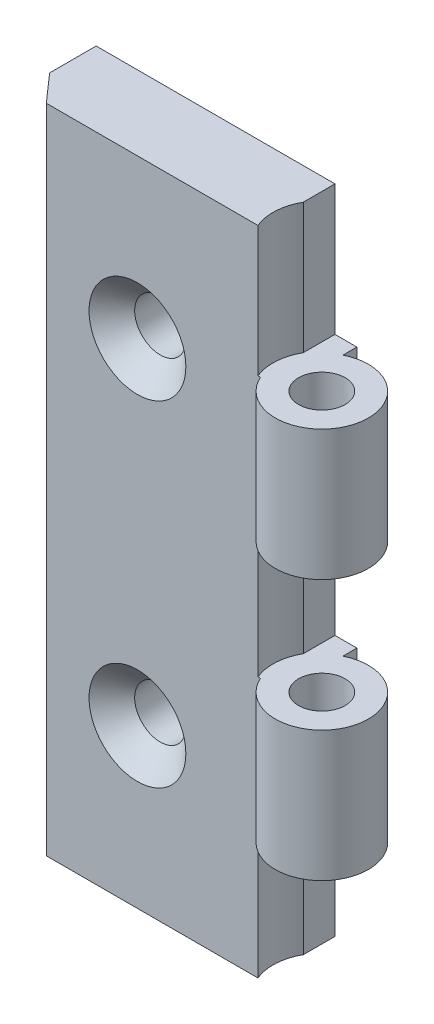
ISO-10303-21;
HEADER;
FILE_DESCRIPTION(('STEP AP214'),'2;1');
FILE_NAME('part.step','',(''),(''),'','','');
FILE_SCHEMA(('AUTOMOTIVE_DESIGN { 1 0 10303 214 1 1 1 1 }'));
ENDSEC;
DATA;
#1=APPLICATION_CONTEXT('core data for automotive mechanical design processes');
#2=APPLICATION_PROTOCOL_DEFINITION('international standard','automotive_design',2000,#1);
#3=PRODUCT_CONTEXT('',#1,'mechanical');
#4=PRODUCT('Part','Part','',(#3));
#5=PRODUCT_RELATED_PRODUCT_CATEGORY('part','',(#4));
#6=PRODUCT_DEFINITION_FORMATION('','',#4);
#7=PRODUCT_DEFINITION_CONTEXT('part definition',#1,'design');
#8=PRODUCT_DEFINITION('design','',#6,#7);
#9=PRODUCT_DEFINITION_SHAPE('','',#8);
#10=(LENGTH_UNIT() NAMED_UNIT(*) SI_UNIT(.MILLI.,.METRE.));
#11=(NAMED_UNIT(*) PLANE_ANGLE_UNIT() SI_UNIT($,.RADIAN.));
#12=(NAMED_UNIT(*) SI_UNIT($,.STERADIAN.) SOLID_ANGLE_UNIT());
#13=UNCERTAINTY_MEASURE_WITH_UNIT(LENGTH_MEASURE(1.E-05),#10,'distance_accuracy_value','');
#14=(GEOMETRIC_REPRESENTATION_CONTEXT(3) GLOBAL_UNCERTAINTY_ASSIGNED_CONTEXT((#13)) GLOBAL_UNIT_ASSIGNED_CONTEXT((#10,
#11,#12)) REPRESENTATION_CONTEXT('',''));
#15=CARTESIAN_POINT('',(0.,0.,0.));
#16=DIRECTION('',(0.,0.,1.));
#17=DIRECTION('',(1.,0.,0.));
#18=AXIS2_PLACEMENT_3D('',#15,#16,#17);
#19=CARTESIAN_POINT('',(30.2196762219613,35.,5.98029435078316));
#20=DIRECTION('',(0.,-1.,0.));
#21=DIRECTION('',(0.,0.,-1.));
#22=AXIS2_PLACEMENT_3D('',#19,#20,#21);
#23=CYLINDRICAL_SURFACE('',#22,5.);
#24=CARTESIAN_POINT('',(30.2196762219613,7.,5.98029435078316));
#25=DIRECTION('',(0.,1.,0.));
#26=DIRECTION('',(0.,0.,1.));
#27=AXIS2_PLACEMENT_3D('',#24,#25,#26);
#28=CIRCLE('',#27,5.);
#29=CARTESIAN_POINT('',(25.6457513110646,7.,8.00000000000001));
#30=VERTEX_POINT('',#29);
#31=CARTESIAN_POINT('',(28.,7.,1.5));
#32=VERTEX_POINT('',#31);
#33=EDGE_CURVE('E276',#30,#32,#28,.T.);
#34=ORIENTED_EDGE('',*,*,#33,.T.);
#35=DIRECTION('',(0.,-1.,0.));
#36=VECTOR('',#35,1.);
#37=CARTESIAN_POINT('',(28.,35.,1.5));
#38=LINE('',#37,#36);
#39=CARTESIAN_POINT('',(28.,21.,1.5));
#40=VERTEX_POINT('',#39);
#41=EDGE_CURVE('E306',#40,#32,#38,.T.);
#42=ORIENTED_EDGE('',*,*,#41,.F.);
#43=CARTESIAN_POINT('',(30.2196762219613,21.,5.98029435078316));
#44=DIRECTION('',(0.,-1.,0.));
#45=DIRECTION('',(0.,0.,-1.));
#46=AXIS2_PLACEMENT_3D('',#43,#44,#45);
#47=CIRCLE('',#46,5.);
#48=CARTESIAN_POINT('',(25.6457513110646,21.,8.));
#49=VERTEX_POINT('',#48);
#50=EDGE_CURVE('E270',#40,#49,#47,.T.);
#51=ORIENTED_EDGE('',*,*,#50,.T.);
#52=DIRECTION('',(0.,-1.,0.));
#53=VECTOR('',#52,1.);
#54=CARTESIAN_POINT('',(25.6457513110646,35.,8.));
#55=LINE('',#54,#53);
#56=EDGE_CURVE('E309',#49,#30,#55,.T.);
#57=ORIENTED_EDGE('',*,*,#56,.T.);
#58=EDGE_LOOP('',(#34,#42,#51,#57));
#59=FACE_BOUND('',#58,.T.);
#60=ADVANCED_FACE('F35',(#59),#23,.T.);
#61=CARTESIAN_POINT('',(28.,35.,0.));
#62=DIRECTION('',(-1.,0.,0.));
#63=DIRECTION('',(0.,0.,1.));
#64=AXIS2_PLACEMENT_3D('',#61,#62,#63);
#65=PLANE('',#64);
#66=ORIENTED_EDGE('',*,*,#41,.T.);
#67=DIRECTION('',(0.,0.,-1.));
#68=VECTOR('',#67,1.);
#69=CARTESIAN_POINT('',(28.,7.,0.));
#70=LINE('',#69,#68);
#71=CARTESIAN_POINT('',(28.,7.,0.));
#72=VERTEX_POINT('',#71);
#73=EDGE_CURVE('E274',#32,#72,#70,.T.);
#74=ORIENTED_EDGE('',*,*,#73,.T.);
#75=DIRECTION('',(0.,-1.,0.));
#76=VECTOR('',#75,1.);
#77=CARTESIAN_POINT('',(28.,35.,0.));
#78=LINE('',#77,#76);
#79=CARTESIAN_POINT('',(28.,21.,0.));
#80=VERTEX_POINT('',#79);
#81=EDGE_CURVE('E302',#80,#72,#78,.T.);
#82=ORIENTED_EDGE('',*,*,#81,.F.);
#83=DIRECTION('',(0.,0.,1.));
#84=VECTOR('',#83,1.);
#85=CARTESIAN_POINT('',(28.,21.,0.));
#86=LINE('',#85,#84);
#87=EDGE_CURVE('E268',#80,#40,#86,.T.);
#88=ORIENTED_EDGE('',*,*,#87,.T.);
#89=EDGE_LOOP('',(#66,#74,#82,#88));
#90=FACE_BOUND('',#89,.T.);
#91=ADVANCED_FACE('F386',(#90),#65,.F.);
#92=CARTESIAN_POINT('',(30.2196762219613,35.,5.98029435078316));
#93=DIRECTION('',(0.,1.,0.));
#94=DIRECTION('',(0.,0.,1.));
#95=AXIS2_PLACEMENT_3D('',#92,#93,#94);
#96=PLANE('',#95);
#97=CARTESIAN_POINT('',(30.2196762219613,35.,5.98029435078316));
#98=DIRECTION('',(0.,1.,0.));
#99=DIRECTION('',(0.,0.,1.));
#100=AXIS2_PLACEMENT_3D('',#97,#98,#99);
#101=CIRCLE('',#100,5.25);
#102=CARTESIAN_POINT('',(25.6457513110646,35.,3.40314264599776));
#103=VERTEX_POINT('',#102);
#104=CARTESIAN_POINT('',(25.3737202697759,35.,8.));
#105=VERTEX_POINT('',#104);
#106=EDGE_CURVE('E197',#103,#105,#101,.T.);
#107=ORIENTED_EDGE('',*,*,#106,.F.);
#108=DIRECTION('',(0.,0.,-1.));
#109=VECTOR('',#108,1.);
#110=CARTESIAN_POINT('',(25.6457513110646,35.,10.9802943507832));
#111=LINE('',#110,#109);
#112=CARTESIAN_POINT('',(25.6457513110646,35.,0.));
#113=VERTEX_POINT('',#112);
#114=EDGE_CURVE('E251',#103,#113,#111,.T.);
#115=ORIENTED_EDGE('',*,*,#114,.T.);
#116=DIRECTION('',(-1.,0.,0.));
#117=VECTOR('',#116,1.);
#118=CARTESIAN_POINT('',(0.,35.,0.));
#119=LINE('',#118,#117);
#120=CARTESIAN_POINT('',(0.,35.,0.));
#121=VERTEX_POINT('',#120);
#122=EDGE_CURVE('E288',#113,#121,#119,.T.);
#123=ORIENTED_EDGE('',*,*,#122,.T.);
#124=DIRECTION('',(0.,0.,1.));
#125=VECTOR('',#124,1.);
#126=CARTESIAN_POINT('',(0.,35.,0.));
#127=LINE('',#126,#125);
#128=CARTESIAN_POINT('',(0.,35.,5.));
#129=VERTEX_POINT('',#128);
#130=EDGE_CURVE('E279',#121,#129,#127,.T.);
#131=ORIENTED_EDGE('',*,*,#130,.T.);
#132=DIRECTION('',(0.661437827766148,0.,0.75));
#133=VECTOR('',#132,1.);
#134=CARTESIAN_POINT('',(0.,35.,5.));
#135=LINE('',#134,#133);
#136=CARTESIAN_POINT('',(2.64575131106459,35.,8.));
#137=VERTEX_POINT('',#136);
#138=EDGE_CURVE('E282',#129,#137,#135,.T.);
#139=ORIENTED_EDGE('',*,*,#138,.T.);
#140=DIRECTION('',(1.,0.,0.));
#141=VECTOR('',#140,1.);
#142=CARTESIAN_POINT('',(2.64575131106459,35.,8.));
#143=LINE('',#142,#141);
#144=EDGE_CURVE('E285',#137,#105,#143,.T.);
#145=ORIENTED_EDGE('',*,*,#144,.T.);
#146=EDGE_LOOP('',(#107,#115,#123,#131,#139,#145));
#147=FACE_BOUND('',#146,.T.);
#148=ADVANCED_FACE('F374',(#147),#96,.T.);
#149=CARTESIAN_POINT('',(30.2196762219613,-35.,5.98029435078316));
#150=DIRECTION('',(0.,1.,0.));
#151=DIRECTION('',(0.,0.,1.));
#152=AXIS2_PLACEMENT_3D('',#149,#150,#151);
#153=PLANE('',#152);
#154=DIRECTION('',(0.,0.,-1.));
#155=VECTOR('',#154,1.);
#156=CARTESIAN_POINT('',(25.6457513110646,-35.,10.9802943507832));
#157=LINE('',#156,#155);
#158=CARTESIAN_POINT('',(25.6457513110646,-35.,3.40314264599776));
#159=VERTEX_POINT('',#158);
#160=CARTESIAN_POINT('',(25.6457513110646,-35.,0.));
#161=VERTEX_POINT('',#160);
#162=EDGE_CURVE('E249',#159,#161,#157,.T.);
#163=ORIENTED_EDGE('',*,*,#162,.F.);
#164=CARTESIAN_POINT('',(30.2196762219613,-35.,5.98029435078316));
#165=DIRECTION('',(0.,1.,0.));
#166=DIRECTION('',(0.,0.,1.));
#167=AXIS2_PLACEMENT_3D('',#164,#165,#166);
#168=CIRCLE('',#167,5.25);
#169=CARTESIAN_POINT('',(25.3737202697759,-35.,8.));
#170=VERTEX_POINT('',#169);
#171=EDGE_CURVE('E169',#170,#159,#168,.F.);
#172=ORIENTED_EDGE('',*,*,#171,.F.);
#173=DIRECTION('',(1.,0.,0.));
#174=VECTOR('',#173,1.);
#175=CARTESIAN_POINT('',(2.64575131106459,-35.,8.));
#176=LINE('',#175,#174);
#177=CARTESIAN_POINT('',(2.64575131106459,-35.,8.));
#178=VERTEX_POINT('',#177);
#179=EDGE_CURVE('E181',#178,#170,#176,.T.);
#180=ORIENTED_EDGE('',*,*,#179,.F.);
#181=DIRECTION('',(0.661437827766148,0.,0.75));
#182=VECTOR('',#181,1.);
#183=CARTESIAN_POINT('',(0.,-35.,5.));
#184=LINE('',#183,#182);
#185=CARTESIAN_POINT('',(0.,-35.,5.));
#186=VERTEX_POINT('',#185);
#187=EDGE_CURVE('E293',#186,#178,#184,.T.);
#188=ORIENTED_EDGE('',*,*,#187,.F.);
#189=DIRECTION('',(0.,0.,1.));
#190=VECTOR('',#189,1.);
#191=CARTESIAN_POINT('',(0.,-35.,0.));
#192=LINE('',#191,#190);
#193=CARTESIAN_POINT('',(0.,-35.,0.));
#194=VERTEX_POINT('',#193);
#195=EDGE_CURVE('E278',#194,#186,#192,.T.);
#196=ORIENTED_EDGE('',*,*,#195,.F.);
#197=DIRECTION('',(-1.,0.,0.));
#198=VECTOR('',#197,1.);
#199=CARTESIAN_POINT('',(0.,-35.,0.));
#200=LINE('',#199,#198);
#201=EDGE_CURVE('E283',#161,#194,#200,.T.);
#202=ORIENTED_EDGE('',*,*,#201,.F.);
#203=EDGE_LOOP('',(#163,#172,#180,#188,#196,#202));
#204=FACE_BOUND('',#203,.T.);
#205=ADVANCED_FACE('F365',(#204),#153,.F.);
#206=CARTESIAN_POINT('',(0.,35.,0.));
#207=DIRECTION('',(1.,0.,0.));
#208=DIRECTION('',(0.,0.,-1.));
#209=AXIS2_PLACEMENT_3D('',#206,#207,#208);
#210=PLANE('',#209);
#211=ORIENTED_EDGE('',*,*,#195,.T.);
#212=DIRECTION('',(0.,-1.,0.));
#213=VECTOR('',#212,1.);
#214=CARTESIAN_POINT('',(0.,35.,5.));
#215=LINE('',#214,#213);
#216=EDGE_CURVE('E312',#129,#186,#215,.T.);
#217=ORIENTED_EDGE('',*,*,#216,.F.);
#218=ORIENTED_EDGE('',*,*,#130,.F.);
#219=DIRECTION('',(0.,-1.,0.));
#220=VECTOR('',#219,1.);
#221=CARTESIAN_POINT('',(0.,35.,0.));
#222=LINE('',#221,#220);
#223=EDGE_CURVE('E290',#121,#194,#222,.T.);
#224=ORIENTED_EDGE('',*,*,#223,.T.);
#225=EDGE_LOOP('',(#211,#217,#218,#224));
#226=FACE_BOUND('',#225,.T.);
#227=ADVANCED_FACE('F37',(#226),#210,.F.);
#228=CARTESIAN_POINT('',(0.,35.,5.));
#229=DIRECTION('',(0.75,0.,-0.661437827766148));
#230=DIRECTION('',(-0.661437827766148,0.,-0.75));
#231=AXIS2_PLACEMENT_3D('',#228,#229,#230);
#232=PLANE('',#231);
#233=ORIENTED_EDGE('',*,*,#187,.T.);
#234=DIRECTION('',(0.,-1.,0.));
#235=VECTOR('',#234,1.);
#236=CARTESIAN_POINT('',(2.64575131106459,35.,8.));
#237=LINE('',#236,#235);
#238=EDGE_CURVE('E310',#137,#178,#237,.T.);
#239=ORIENTED_EDGE('',*,*,#238,.F.);
#240=ORIENTED_EDGE('',*,*,#138,.F.);
#241=ORIENTED_EDGE('',*,*,#216,.T.);
#242=EDGE_LOOP('',(#233,#239,#240,#241));
#243=FACE_BOUND('',#242,.T.);
#244=ADVANCED_FACE('F393',(#243),#232,.F.);
#245=CARTESIAN_POINT('',(2.64575131106459,35.,8.));
#246=DIRECTION('',(0.,0.,-1.));
#247=DIRECTION('',(-1.,0.,0.));
#248=AXIS2_PLACEMENT_3D('',#245,#246,#247);
#249=PLANE('',#248);
#250=ORIENTED_EDGE('',*,*,#179,.T.);
#251=DIRECTION('',(0.,1.,0.));
#252=VECTOR('',#251,1.);
#253=CARTESIAN_POINT('',(25.3737202697759,-49.8492424049175,8.));
#254=LINE('',#253,#252);
#255=CARTESIAN_POINT('',(25.3737202697759,-21.,8.));
#256=VERTEX_POINT('',#255);
#257=EDGE_CURVE('E168',#170,#256,#254,.T.);
#258=ORIENTED_EDGE('',*,*,#257,.T.);
#259=DIRECTION('',(1.,0.,0.));
#260=VECTOR('',#259,1.);
#261=CARTESIAN_POINT('',(2.64575131106459,-21.,8.));
#262=LINE('',#261,#260);
#263=CARTESIAN_POINT('',(25.6457513110646,-21.,8.));
#264=VERTEX_POINT('',#263);
#265=EDGE_CURVE('E158',#256,#264,#262,.T.);
#266=ORIENTED_EDGE('',*,*,#265,.T.);
#267=CARTESIAN_POINT('',(25.6457513110646,-7.,8.00000000000001));
#268=VERTEX_POINT('',#267);
#269=EDGE_CURVE('E307',#268,#264,#55,.T.);
#270=ORIENTED_EDGE('',*,*,#269,.F.);
#271=DIRECTION('',(-1.,0.,0.));
#272=VECTOR('',#271,1.);
#273=CARTESIAN_POINT('',(2.64575131106459,-7.00000000000001,8.));
#274=LINE('',#273,#272);
#275=CARTESIAN_POINT('',(25.3737202697759,-7.,8.));
#276=VERTEX_POINT('',#275);
#277=EDGE_CURVE('E189',#268,#276,#274,.T.);
#278=ORIENTED_EDGE('',*,*,#277,.T.);
#279=DIRECTION('',(0.,1.,0.));
#280=VECTOR('',#279,1.);
#281=CARTESIAN_POINT('',(25.3737202697759,-21.8492424049175,8.));
#282=LINE('',#281,#280);
#283=CARTESIAN_POINT('',(25.3737202697759,7.,8.));
#284=VERTEX_POINT('',#283);
#285=EDGE_CURVE('E194',#276,#284,#282,.T.);
#286=ORIENTED_EDGE('',*,*,#285,.T.);
#287=DIRECTION('',(1.,0.,0.));
#288=VECTOR('',#287,1.);
#289=CARTESIAN_POINT('',(2.64575131106459,7.,8.));
#290=LINE('',#289,#288);
#291=EDGE_CURVE('E192',#284,#30,#290,.T.);
#292=ORIENTED_EDGE('',*,*,#291,.T.);
#293=ORIENTED_EDGE('',*,*,#56,.F.);
#294=DIRECTION('',(-1.,0.,0.));
#295=VECTOR('',#294,1.);
#296=CARTESIAN_POINT('',(2.64575131106459,21.,8.));
#297=LINE('',#296,#295);
#298=CARTESIAN_POINT('',(25.3737202697759,21.,8.));
#299=VERTEX_POINT('',#298);
#300=EDGE_CURVE('E208',#49,#299,#297,.T.);
#301=ORIENTED_EDGE('',*,*,#300,.T.);
#302=DIRECTION('',(0.,1.,0.));
#303=VECTOR('',#302,1.);
#304=CARTESIAN_POINT('',(25.3737202697759,6.15075759508251,8.));
#305=LINE('',#304,#303);
#306=EDGE_CURVE('E205',#299,#105,#305,.T.);
#307=ORIENTED_EDGE('',*,*,#306,.T.);
#308=ORIENTED_EDGE('',*,*,#144,.F.);
#309=ORIENTED_EDGE('',*,*,#238,.T.);
#310=EDGE_LOOP('',(#250,#258,#266,#270,#278,#286,#292,#293,#301,#307,#308,#309));
#311=FACE_BOUND('',#310,.T.);
#312=CARTESIAN_POINT('',(12.432713766513,18.,8.));
#313=DIRECTION('',(0.,0.,1.));
#314=DIRECTION('',(1.,0.,0.));
#315=AXIS2_PLACEMENT_3D('',#312,#313,#314);
#316=CIRCLE('',#315,5.2);
#317=CARTESIAN_POINT('',(17.632713766513,18.,8.));
#318=VERTEX_POINT('',#317);
#319=EDGE_CURVE('E211',#318,#318,#316,.T.);
#320=ORIENTED_EDGE('',*,*,#319,.F.);
#321=EDGE_LOOP('',(#320));
#322=FACE_BOUND('',#321,.T.);
#323=CARTESIAN_POINT('',(12.432713766513,-18.,8.));
#324=DIRECTION('',(0.,0.,1.));
#325=DIRECTION('',(1.,0.,0.));
#326=AXIS2_PLACEMENT_3D('',#323,#324,#325);
#327=CIRCLE('',#326,5.2);
#328=CARTESIAN_POINT('',(17.632713766513,-18.,8.));
#329=VERTEX_POINT('',#328);
#330=EDGE_CURVE('E218',#329,#329,#327,.T.);
#331=ORIENTED_EDGE('',*,*,#330,.F.);
#332=EDGE_LOOP('',(#331));
#333=FACE_BOUND('',#332,.T.);
#334=ADVANCED_FACE('F177',(#311,#322,#333),#249,.F.);
#335=CARTESIAN_POINT('',(30.2196762219613,-21.,5.98029435078316));
#336=DIRECTION('',(0.,1.,0.));
#337=DIRECTION('',(0.,0.,1.));
#338=AXIS2_PLACEMENT_3D('',#335,#336,#337);
#339=CIRCLE('',#338,5.);
#340=CARTESIAN_POINT('',(28.,-21.,1.5));
#341=VERTEX_POINT('',#340);
#342=EDGE_CURVE('E163',#264,#341,#339,.T.);
#343=ORIENTED_EDGE('',*,*,#342,.T.);
#344=CARTESIAN_POINT('',(28.,-7.00000000000001,1.5));
#345=VERTEX_POINT('',#344);
#346=EDGE_CURVE('E303',#345,#341,#38,.T.);
#347=ORIENTED_EDGE('',*,*,#346,.F.);
#348=CARTESIAN_POINT('',(30.2196762219613,-7.00000000000001,5.98029435078316));
#349=DIRECTION('',(0.,-1.,0.));
#350=DIRECTION('',(0.,0.,-1.));
#351=AXIS2_PLACEMENT_3D('',#348,#349,#350);
#352=CIRCLE('',#351,5.);
#353=EDGE_CURVE('E260',#345,#268,#352,.T.);
#354=ORIENTED_EDGE('',*,*,#353,.T.);
#355=ORIENTED_EDGE('',*,*,#269,.T.);
#356=EDGE_LOOP('',(#343,#347,#354,#355));
#357=FACE_BOUND('',#356,.T.);
#358=ADVANCED_FACE('F355',(#357),#23,.T.);
#359=ORIENTED_EDGE('',*,*,#346,.T.);
#360=DIRECTION('',(0.,0.,-1.));
#361=VECTOR('',#360,1.);
#362=CARTESIAN_POINT('',(28.,-21.,0.));
#363=LINE('',#362,#361);
#364=CARTESIAN_POINT('',(28.,-21.,0.));
#365=VERTEX_POINT('',#364);
#366=EDGE_CURVE('E264',#341,#365,#363,.T.);
#367=ORIENTED_EDGE('',*,*,#366,.T.);
#368=CARTESIAN_POINT('',(28.,-7.00000000000001,0.));
#369=VERTEX_POINT('',#368);
#370=EDGE_CURVE('E299',#369,#365,#78,.T.);
#371=ORIENTED_EDGE('',*,*,#370,.F.);
#372=DIRECTION('',(0.,0.,1.));
#373=VECTOR('',#372,1.);
#374=CARTESIAN_POINT('',(28.,-7.00000000000001,0.));
#375=LINE('',#374,#373);
#376=EDGE_CURVE('E258',#369,#345,#375,.T.);
#377=ORIENTED_EDGE('',*,*,#376,.T.);
#378=EDGE_LOOP('',(#359,#367,#371,#377));
#379=FACE_BOUND('',#378,.T.);
#380=ADVANCED_FACE('F357',(#379),#65,.F.);
#381=CARTESIAN_POINT('',(0.,35.,0.));
#382=DIRECTION('',(0.,0.,1.));
#383=DIRECTION('',(1.,0.,0.));
#384=AXIS2_PLACEMENT_3D('',#381,#382,#383);
#385=PLANE('',#384);
#386=CARTESIAN_POINT('',(12.432713766513,18.,0.));
#387=DIRECTION('',(0.,0.,1.));
#388=DIRECTION('',(1.,0.,0.));
#389=AXIS2_PLACEMENT_3D('',#386,#387,#388);
#390=CIRCLE('',#389,2.75);
#391=CARTESIAN_POINT('',(15.182713766513,18.,0.));
#392=VERTEX_POINT('',#391);
#393=EDGE_CURVE('E217',#392,#392,#390,.T.);
#394=ORIENTED_EDGE('',*,*,#393,.T.);
#395=EDGE_LOOP('',(#394));
#396=FACE_BOUND('',#395,.T.);
#397=CARTESIAN_POINT('',(12.432713766513,-18.,0.));
#398=DIRECTION('',(0.,0.,1.));
#399=DIRECTION('',(1.,0.,0.));
#400=AXIS2_PLACEMENT_3D('',#397,#398,#399);
#401=CIRCLE('',#400,2.75);
#402=CARTESIAN_POINT('',(15.182713766513,-18.,0.));
#403=VERTEX_POINT('',#402);
#404=EDGE_CURVE('E224',#403,#403,#401,.T.);
#405=ORIENTED_EDGE('',*,*,#404,.T.);
#406=EDGE_LOOP('',(#405));
#407=FACE_BOUND('',#406,.T.);
#408=DIRECTION('',(0.,1.,0.));
#409=VECTOR('',#408,1.);
#410=CARTESIAN_POINT('',(25.6457513110646,35.,0.));
#411=LINE('',#410,#409);
#412=CARTESIAN_POINT('',(25.6457513110646,21.,0.));
#413=VERTEX_POINT('',#412);
#414=EDGE_CURVE('E234',#413,#113,#411,.T.);
#415=ORIENTED_EDGE('',*,*,#414,.F.);
#416=DIRECTION('',(-1.,0.,0.));
#417=VECTOR('',#416,1.);
#418=CARTESIAN_POINT('',(44.7936011328581,21.,0.));
#419=LINE('',#418,#417);
#420=EDGE_CURVE('E231',#80,#413,#419,.T.);
#421=ORIENTED_EDGE('',*,*,#420,.F.);
#422=ORIENTED_EDGE('',*,*,#81,.T.);
#423=DIRECTION('',(1.,0.,0.));
#424=VECTOR('',#423,1.);
#425=CARTESIAN_POINT('',(44.7936011328581,7.,0.));
#426=LINE('',#425,#424);
#427=CARTESIAN_POINT('',(25.6457513110646,7.,0.));
#428=VERTEX_POINT('',#427);
#429=EDGE_CURVE('E228',#428,#72,#426,.T.);
#430=ORIENTED_EDGE('',*,*,#429,.F.);
#431=DIRECTION('',(0.,1.,0.));
#432=VECTOR('',#431,1.);
#433=CARTESIAN_POINT('',(25.6457513110646,7.,0.));
#434=LINE('',#433,#432);
#435=CARTESIAN_POINT('',(25.6457513110646,-7.,0.));
#436=VERTEX_POINT('',#435);
#437=EDGE_CURVE('E225',#436,#428,#434,.T.);
#438=ORIENTED_EDGE('',*,*,#437,.F.);
#439=DIRECTION('',(-1.,0.,0.));
#440=VECTOR('',#439,1.);
#441=CARTESIAN_POINT('',(44.7936011328581,-7.,0.));
#442=LINE('',#441,#440);
#443=EDGE_CURVE('E242',#369,#436,#442,.T.);
#444=ORIENTED_EDGE('',*,*,#443,.F.);
#445=ORIENTED_EDGE('',*,*,#370,.T.);
#446=DIRECTION('',(1.,0.,0.));
#447=VECTOR('',#446,1.);
#448=CARTESIAN_POINT('',(44.7936011328581,-21.,0.));
#449=LINE('',#448,#447);
#450=CARTESIAN_POINT('',(25.6457513110646,-21.,0.));
#451=VERTEX_POINT('',#450);
#452=EDGE_CURVE('E240',#451,#365,#449,.T.);
#453=ORIENTED_EDGE('',*,*,#452,.F.);
#454=DIRECTION('',(0.,1.,0.));
#455=VECTOR('',#454,1.);
#456=CARTESIAN_POINT('',(25.6457513110646,-21.,0.));
#457=LINE('',#456,#455);
#458=EDGE_CURVE('E237',#161,#451,#457,.T.);
#459=ORIENTED_EDGE('',*,*,#458,.F.);
#460=ORIENTED_EDGE('',*,*,#201,.T.);
#461=ORIENTED_EDGE('',*,*,#223,.F.);
#462=ORIENTED_EDGE('',*,*,#122,.F.);
#463=EDGE_LOOP('',(#415,#421,#422,#430,#438,#444,#445,#453,#459,#460,#461,#462));
#464=FACE_BOUND('',#463,.T.);
#465=ADVANCED_FACE('F341',(#396,#407,#464),#385,.F.);
#466=CARTESIAN_POINT('',(44.7936011328581,7.,10.9802943507832));
#467=DIRECTION('',(0.,1.,0.));
#468=DIRECTION('',(0.,0.,1.));
#469=AXIS2_PLACEMENT_3D('',#466,#467,#468);
#470=PLANE('',#469);
#471=ORIENTED_EDGE('',*,*,#429,.T.);
#472=ORIENTED_EDGE('',*,*,#73,.F.);
#473=ORIENTED_EDGE('',*,*,#33,.F.);
#474=ORIENTED_EDGE('',*,*,#291,.F.);
#475=CARTESIAN_POINT('',(30.2196762219613,7.,5.98029435078316));
#476=DIRECTION('',(0.,1.,0.));
#477=DIRECTION('',(0.,0.,1.));
#478=AXIS2_PLACEMENT_3D('',#475,#476,#477);
#479=CIRCLE('',#478,5.25);
#480=CARTESIAN_POINT('',(25.6457513110646,7.,3.40314264599775));
#481=VERTEX_POINT('',#480);
#482=EDGE_CURVE('E182',#481,#284,#479,.T.);
#483=ORIENTED_EDGE('',*,*,#482,.F.);
#484=DIRECTION('',(0.,0.,-1.));
#485=VECTOR('',#484,1.);
#486=CARTESIAN_POINT('',(25.6457513110646,7.,10.9802943507832));
#487=LINE('',#486,#485);
#488=EDGE_CURVE('E255',#481,#428,#487,.T.);
#489=ORIENTED_EDGE('',*,*,#488,.T.);
#490=EDGE_LOOP('',(#471,#472,#473,#474,#483,#489));
#491=FACE_BOUND('',#490,.T.);
#492=CARTESIAN_POINT('',(30.2196762219613,7.,5.98029435078316));
#493=DIRECTION('',(0.,1.,0.));
#494=DIRECTION('',(0.,0.,1.));
#495=AXIS2_PLACEMENT_3D('',#492,#493,#494);
#496=CIRCLE('',#495,2.5);
#497=CARTESIAN_POINT('',(30.2196762219613,7.,8.48029435078317));
#498=VERTEX_POINT('',#497);
#499=EDGE_CURVE('E273',#498,#498,#496,.T.);
#500=ORIENTED_EDGE('',*,*,#499,.T.);
#501=EDGE_LOOP('',(#500));
#502=FACE_BOUND('',#501,.T.);
#503=ADVANCED_FACE('F347',(#491,#502),#470,.F.);
#504=CARTESIAN_POINT('',(44.7936011328581,-7.,10.9802943507832));
#505=DIRECTION('',(0.,-1.,0.));
#506=DIRECTION('',(0.,0.,-1.));
#507=AXIS2_PLACEMENT_3D('',#504,#505,#506);
#508=PLANE('',#507);
#509=DIRECTION('',(0.,0.,-1.));
#510=VECTOR('',#509,1.);
#511=CARTESIAN_POINT('',(25.6457513110646,-7.,10.9802943507832));
#512=LINE('',#511,#510);
#513=CARTESIAN_POINT('',(25.6457513110646,-7.,3.40314264599775));
#514=VERTEX_POINT('',#513);
#515=EDGE_CURVE('E245',#514,#436,#512,.T.);
#516=ORIENTED_EDGE('',*,*,#515,.F.);
#517=CARTESIAN_POINT('',(30.2196762219613,-7.,5.98029435078316));
#518=DIRECTION('',(0.,-1.,0.));
#519=DIRECTION('',(0.,0.,-1.));
#520=AXIS2_PLACEMENT_3D('',#517,#518,#519);
#521=CIRCLE('',#520,5.25);
#522=EDGE_CURVE('E58',#514,#276,#521,.F.);
#523=ORIENTED_EDGE('',*,*,#522,.T.);
#524=ORIENTED_EDGE('',*,*,#277,.F.);
#525=ORIENTED_EDGE('',*,*,#353,.F.);
#526=ORIENTED_EDGE('',*,*,#376,.F.);
#527=ORIENTED_EDGE('',*,*,#443,.T.);
#528=EDGE_LOOP('',(#516,#523,#524,#525,#526,#527));
#529=FACE_BOUND('',#528,.T.);
#530=CARTESIAN_POINT('',(30.2196762219613,-7.00000000000001,5.98029435078316));
#531=DIRECTION('',(0.,-1.,0.));
#532=DIRECTION('',(0.,0.,-1.));
#533=AXIS2_PLACEMENT_3D('',#530,#531,#532);
#534=CIRCLE('',#533,2.5);
#535=CARTESIAN_POINT('',(30.2196762219613,-7.00000000000001,3.48029435078316));
#536=VERTEX_POINT('',#535);
#537=EDGE_CURVE('E257',#536,#536,#534,.T.);
#538=ORIENTED_EDGE('',*,*,#537,.T.);
#539=EDGE_LOOP('',(#538));
#540=FACE_BOUND('',#539,.T.);
#541=ADVANCED_FACE('F332',(#529,#540),#508,.F.);
#542=CARTESIAN_POINT('',(25.6457513110646,7.,10.9802943507832));
#543=DIRECTION('',(-1.,0.,0.));
#544=DIRECTION('',(0.,-1.,0.));
#545=AXIS2_PLACEMENT_3D('',#542,#543,#544);
#546=PLANE('',#545);
#547=ORIENTED_EDGE('',*,*,#488,.F.);
#548=DIRECTION('',(0.,1.,0.));
#549=VECTOR('',#548,1.);
#550=CARTESIAN_POINT('',(25.6457513110646,-21.8492424049175,3.40314264599775));
#551=LINE('',#550,#549);
#552=EDGE_CURVE('E43',#481,#514,#551,.F.);
#553=ORIENTED_EDGE('',*,*,#552,.T.);
#554=ORIENTED_EDGE('',*,*,#515,.T.);
#555=ORIENTED_EDGE('',*,*,#437,.T.);
#556=EDGE_LOOP('',(#547,#553,#554,#555));
#557=FACE_BOUND('',#556,.T.);
#558=ADVANCED_FACE('F329',(#557),#546,.F.);
#559=CARTESIAN_POINT('',(44.7936011328581,-21.,10.9802943507832));
#560=DIRECTION('',(0.,1.,0.));
#561=DIRECTION('',(0.,0.,1.));
#562=AXIS2_PLACEMENT_3D('',#559,#560,#561);
#563=PLANE('',#562);
#564=ORIENTED_EDGE('',*,*,#452,.T.);
#565=ORIENTED_EDGE('',*,*,#366,.F.);
#566=ORIENTED_EDGE('',*,*,#342,.F.);
#567=ORIENTED_EDGE('',*,*,#265,.F.);
#568=CARTESIAN_POINT('',(30.2196762219613,-21.,5.98029435078316));
#569=DIRECTION('',(0.,1.,0.));
#570=DIRECTION('',(0.,0.,1.));
#571=AXIS2_PLACEMENT_3D('',#568,#569,#570);
#572=CIRCLE('',#571,5.25);
#573=CARTESIAN_POINT('',(25.6457513110646,-21.,3.40314264599776));
#574=VERTEX_POINT('',#573);
#575=EDGE_CURVE('E50',#574,#256,#572,.T.);
#576=ORIENTED_EDGE('',*,*,#575,.F.);
#577=DIRECTION('',(0.,0.,-1.));
#578=VECTOR('',#577,1.);
#579=CARTESIAN_POINT('',(25.6457513110646,-21.,10.9802943507832));
#580=LINE('',#579,#578);
#581=EDGE_CURVE('E247',#574,#451,#580,.T.);
#582=ORIENTED_EDGE('',*,*,#581,.T.);
#583=EDGE_LOOP('',(#564,#565,#566,#567,#576,#582));
#584=FACE_BOUND('',#583,.T.);
#585=CARTESIAN_POINT('',(30.2196762219613,-21.,5.98029435078316));
#586=DIRECTION('',(0.,1.,0.));
#587=DIRECTION('',(0.,0.,1.));
#588=AXIS2_PLACEMENT_3D('',#585,#586,#587);
#589=CIRCLE('',#588,2.5);
#590=CARTESIAN_POINT('',(30.2196762219613,-21.,8.48029435078317));
#591=VERTEX_POINT('',#590);
#592=EDGE_CURVE('E263',#591,#591,#589,.T.);
#593=ORIENTED_EDGE('',*,*,#592,.T.);
#594=EDGE_LOOP('',(#593));
#595=FACE_BOUND('',#594,.T.);
#596=ADVANCED_FACE('F160',(#584,#595),#563,.F.);
#597=CARTESIAN_POINT('',(25.6457513110646,-21.,10.9802943507832));
#598=DIRECTION('',(-1.,0.,0.));
#599=DIRECTION('',(0.,0.,1.));
#600=AXIS2_PLACEMENT_3D('',#597,#598,#599);
#601=PLANE('',#600);
#602=ORIENTED_EDGE('',*,*,#581,.F.);
#603=DIRECTION('',(0.,1.,0.));
#604=VECTOR('',#603,1.);
#605=CARTESIAN_POINT('',(25.6457513110646,-49.8492424049175,3.40314264599776));
#606=LINE('',#605,#604);
#607=EDGE_CURVE('E12',#574,#159,#606,.F.);
#608=ORIENTED_EDGE('',*,*,#607,.T.);
#609=ORIENTED_EDGE('',*,*,#162,.T.);
#610=ORIENTED_EDGE('',*,*,#458,.T.);
#611=EDGE_LOOP('',(#602,#608,#609,#610));
#612=FACE_BOUND('',#611,.T.);
#613=ADVANCED_FACE('F362',(#612),#601,.F.);
#614=CARTESIAN_POINT('',(30.2196762219613,35.,5.98029435078316));
#615=DIRECTION('',(0.,-1.,0.));
#616=DIRECTION('',(0.,0.,-1.));
#617=AXIS2_PLACEMENT_3D('',#614,#615,#616);
#618=CYLINDRICAL_SURFACE('',#617,2.5);
#619=ORIENTED_EDGE('',*,*,#499,.F.);
#620=EDGE_LOOP('',(#619));
#621=FACE_BOUND('',#620,.T.);
#622=CARTESIAN_POINT('',(30.2196762219613,21.,5.98029435078316));
#623=DIRECTION('',(0.,-1.,0.));
#624=DIRECTION('',(0.,0.,-1.));
#625=AXIS2_PLACEMENT_3D('',#622,#623,#624);
#626=CIRCLE('',#625,2.5);
#627=CARTESIAN_POINT('',(30.2196762219613,21.,3.48029435078316));
#628=VERTEX_POINT('',#627);
#629=EDGE_CURVE('E267',#628,#628,#626,.T.);
#630=ORIENTED_EDGE('',*,*,#629,.F.);
#631=EDGE_LOOP('',(#630));
#632=FACE_BOUND('',#631,.T.);
#633=ADVANCED_FACE('F425',(#621,#632),#618,.F.);
#634=CARTESIAN_POINT('',(25.6457513110646,35.,10.9802943507832));
#635=DIRECTION('',(-1.,0.,0.));
#636=DIRECTION('',(0.,0.,1.));
#637=AXIS2_PLACEMENT_3D('',#634,#635,#636);
#638=PLANE('',#637);
#639=ORIENTED_EDGE('',*,*,#114,.F.);
#640=DIRECTION('',(0.,1.,0.));
#641=VECTOR('',#640,1.);
#642=CARTESIAN_POINT('',(25.6457513110646,6.15075759508251,3.40314264599776));
#643=LINE('',#642,#641);
#644=CARTESIAN_POINT('',(25.6457513110646,21.,3.40314264599776));
#645=VERTEX_POINT('',#644);
#646=EDGE_CURVE('E202',#103,#645,#643,.F.);
#647=ORIENTED_EDGE('',*,*,#646,.T.);
#648=DIRECTION('',(0.,0.,-1.));
#649=VECTOR('',#648,1.);
#650=CARTESIAN_POINT('',(25.6457513110646,21.,10.9802943507832));
#651=LINE('',#650,#649);
#652=EDGE_CURVE('E253',#645,#413,#651,.T.);
#653=ORIENTED_EDGE('',*,*,#652,.T.);
#654=ORIENTED_EDGE('',*,*,#414,.T.);
#655=EDGE_LOOP('',(#639,#647,#653,#654));
#656=FACE_BOUND('',#655,.T.);
#657=ADVANCED_FACE('F378',(#656),#638,.F.);
#658=CARTESIAN_POINT('',(44.7936011328581,21.,10.9802943507832));
#659=DIRECTION('',(0.,-1.,0.));
#660=DIRECTION('',(0.,0.,-1.));
#661=AXIS2_PLACEMENT_3D('',#658,#659,#660);
#662=PLANE('',#661);
#663=ORIENTED_EDGE('',*,*,#652,.F.);
#664=CARTESIAN_POINT('',(30.2196762219613,21.,5.98029435078316));
#665=DIRECTION('',(0.,-1.,0.));
#666=DIRECTION('',(0.,0.,-1.));
#667=AXIS2_PLACEMENT_3D('',#664,#665,#666);
#668=CIRCLE('',#667,5.25);
#669=EDGE_CURVE('E199',#645,#299,#668,.F.);
#670=ORIENTED_EDGE('',*,*,#669,.T.);
#671=ORIENTED_EDGE('',*,*,#300,.F.);
#672=ORIENTED_EDGE('',*,*,#50,.F.);
#673=ORIENTED_EDGE('',*,*,#87,.F.);
#674=ORIENTED_EDGE('',*,*,#420,.T.);
#675=EDGE_LOOP('',(#663,#670,#671,#672,#673,#674));
#676=FACE_BOUND('',#675,.T.);
#677=ORIENTED_EDGE('',*,*,#629,.T.);
#678=EDGE_LOOP('',(#677));
#679=FACE_BOUND('',#678,.T.);
#680=ADVANCED_FACE('F381',(#676,#679),#662,.F.);
#681=ORIENTED_EDGE('',*,*,#592,.F.);
#682=EDGE_LOOP('',(#681));
#683=FACE_BOUND('',#682,.T.);
#684=ORIENTED_EDGE('',*,*,#537,.F.);
#685=EDGE_LOOP('',(#684));
#686=FACE_BOUND('',#685,.T.);
#687=ADVANCED_FACE('F420',(#683,#686),#618,.F.);
#688=CARTESIAN_POINT('',(12.432713766513,-18.,8.));
#689=DIRECTION('',(0.,0.,1.));
#690=DIRECTION('',(1.,0.,0.));
#691=AXIS2_PLACEMENT_3D('',#688,#689,#690);
#692=CYLINDRICAL_SURFACE('',#691,2.75);
#693=CARTESIAN_POINT('',(12.432713766513,-18.,5.55));
#694=DIRECTION('',(0.,0.,1.));
#695=DIRECTION('',(1.,0.,0.));
#696=AXIS2_PLACEMENT_3D('',#693,#694,#695);
#697=CIRCLE('',#696,2.75);
#698=CARTESIAN_POINT('',(15.182713766513,-18.,5.55));
#699=VERTEX_POINT('',#698);
#700=EDGE_CURVE('E221',#699,#699,#697,.T.);
#701=ORIENTED_EDGE('',*,*,#700,.T.);
#702=EDGE_LOOP('',(#701));
#703=FACE_BOUND('',#702,.T.);
#704=ORIENTED_EDGE('',*,*,#404,.F.);
#705=EDGE_LOOP('',(#704));
#706=FACE_BOUND('',#705,.T.);
#707=ADVANCED_FACE('F423',(#703,#706),#692,.F.);
#708=CARTESIAN_POINT('',(12.432713766513,-18.,8.));
#709=DIRECTION('',(0.,0.,1.));
#710=DIRECTION('',(1.,0.,0.));
#711=AXIS2_PLACEMENT_3D('',#708,#709,#710);
#712=CONICAL_SURFACE('',#711,5.2,0.785398163397448);
#713=ORIENTED_EDGE('',*,*,#700,.F.);
#714=EDGE_LOOP('',(#713));
#715=FACE_BOUND('',#714,.T.);
#716=ORIENTED_EDGE('',*,*,#330,.T.);
#717=EDGE_LOOP('',(#716));
#718=FACE_BOUND('',#717,.T.);
#719=ADVANCED_FACE('F442',(#715,#718),#712,.F.);
#720=CARTESIAN_POINT('',(12.432713766513,18.,8.));
#721=DIRECTION('',(0.,0.,1.));
#722=DIRECTION('',(1.,0.,0.));
#723=AXIS2_PLACEMENT_3D('',#720,#721,#722);
#724=CYLINDRICAL_SURFACE('',#723,2.75);
#725=CARTESIAN_POINT('',(12.432713766513,18.,5.55));
#726=DIRECTION('',(0.,0.,1.));
#727=DIRECTION('',(1.,0.,0.));
#728=AXIS2_PLACEMENT_3D('',#725,#726,#727);
#729=CIRCLE('',#728,2.75);
#730=CARTESIAN_POINT('',(15.182713766513,18.,5.55));
#731=VERTEX_POINT('',#730);
#732=EDGE_CURVE('E214',#731,#731,#729,.T.);
#733=ORIENTED_EDGE('',*,*,#732,.T.);
#734=EDGE_LOOP('',(#733));
#735=FACE_BOUND('',#734,.T.);
#736=ORIENTED_EDGE('',*,*,#393,.F.);
#737=EDGE_LOOP('',(#736));
#738=FACE_BOUND('',#737,.T.);
#739=ADVANCED_FACE('F446',(#735,#738),#724,.F.);
#740=CARTESIAN_POINT('',(12.432713766513,18.,8.));
#741=DIRECTION('',(0.,0.,1.));
#742=DIRECTION('',(1.,0.,0.));
#743=AXIS2_PLACEMENT_3D('',#740,#741,#742);
#744=CONICAL_SURFACE('',#743,5.2,0.785398163397448);
#745=ORIENTED_EDGE('',*,*,#732,.F.);
#746=EDGE_LOOP('',(#745));
#747=FACE_BOUND('',#746,.T.);
#748=ORIENTED_EDGE('',*,*,#319,.T.);
#749=EDGE_LOOP('',(#748));
#750=FACE_BOUND('',#749,.T.);
#751=ADVANCED_FACE('F450',(#747,#750),#744,.F.);
#752=CARTESIAN_POINT('',(30.2196762219613,6.15075759508251,5.98029435078316));
#753=DIRECTION('',(0.,1.,0.));
#754=DIRECTION('',(0.,0.,1.));
#755=AXIS2_PLACEMENT_3D('',#752,#753,#754);
#756=CYLINDRICAL_SURFACE('',#755,5.25);
#757=ORIENTED_EDGE('',*,*,#669,.F.);
#758=ORIENTED_EDGE('',*,*,#646,.F.);
#759=ORIENTED_EDGE('',*,*,#106,.T.);
#760=ORIENTED_EDGE('',*,*,#306,.F.);
#761=EDGE_LOOP('',(#757,#758,#759,#760));
#762=FACE_BOUND('',#761,.T.);
#763=ADVANCED_FACE('F391',(#762),#756,.F.);
#764=CARTESIAN_POINT('',(30.2196762219613,-21.8492424049175,5.98029435078316));
#765=DIRECTION('',(0.,1.,0.));
#766=DIRECTION('',(0.,0.,1.));
#767=AXIS2_PLACEMENT_3D('',#764,#765,#766);
#768=CYLINDRICAL_SURFACE('',#767,5.25);
#769=ORIENTED_EDGE('',*,*,#522,.F.);
#770=ORIENTED_EDGE('',*,*,#552,.F.);
#771=ORIENTED_EDGE('',*,*,#482,.T.);
#772=ORIENTED_EDGE('',*,*,#285,.F.);
#773=EDGE_LOOP('',(#769,#770,#771,#772));
#774=FACE_BOUND('',#773,.T.);
#775=ADVANCED_FACE('F351',(#774),#768,.F.);
#776=CARTESIAN_POINT('',(30.2196762219613,-49.8492424049175,5.98029435078316));
#777=DIRECTION('',(0.,1.,0.));
#778=DIRECTION('',(0.,0.,1.));
#779=AXIS2_PLACEMENT_3D('',#776,#777,#778);
#780=CYLINDRICAL_SURFACE('',#779,5.25);
#781=ORIENTED_EDGE('',*,*,#171,.T.);
#782=ORIENTED_EDGE('',*,*,#607,.F.);
#783=ORIENTED_EDGE('',*,*,#575,.T.);
#784=ORIENTED_EDGE('',*,*,#257,.F.);
#785=EDGE_LOOP('',(#781,#782,#783,#784));
#786=FACE_BOUND('',#785,.T.);
#787=ADVANCED_FACE('F172',(#786),#780,.F.);
#788=CLOSED_SHELL('',(#60,#91,#148,#205,#227,#244,#334,#358,#380,#465,#503,#541,#558,#596,#613,
#633,#657,#680,#687,#707,#719,#739,#751,#763,#775,#787));
#789=MANIFOLD_SOLID_BREP('B2',#788);
#790=ADVANCED_BREP_SHAPE_REPRESENTATION('',(#18,#789),#14);
#791=SHAPE_DEFINITION_REPRESENTATION(#9,#790);
ENDSEC;
END-ISO-10303-21;
